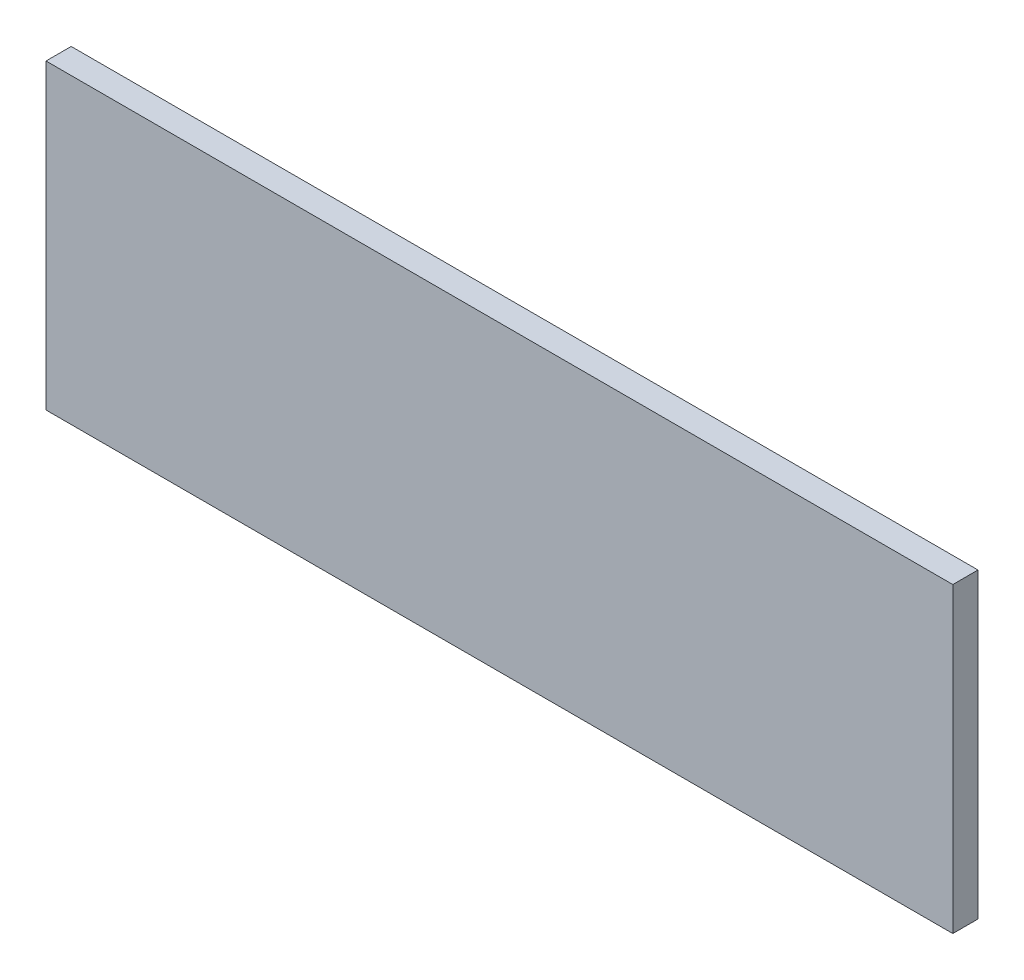
ISO-10303-21;
HEADER;
FILE_DESCRIPTION(('STEP AP214'),'2;1');
FILE_NAME('part.step','',(''),(''),'','','');
FILE_SCHEMA(('AUTOMOTIVE_DESIGN { 1 0 10303 214 1 1 1 1 }'));
ENDSEC;
DATA;
#1=APPLICATION_CONTEXT('core data for automotive mechanical design processes');
#2=APPLICATION_PROTOCOL_DEFINITION('international standard','automotive_design',2000,#1);
#3=PRODUCT_CONTEXT('',#1,'mechanical');
#4=PRODUCT('Part','Part','',(#3));
#5=PRODUCT_RELATED_PRODUCT_CATEGORY('part','',(#4));
#6=PRODUCT_DEFINITION_FORMATION('','',#4);
#7=PRODUCT_DEFINITION_CONTEXT('part definition',#1,'design');
#8=PRODUCT_DEFINITION('design','',#6,#7);
#9=PRODUCT_DEFINITION_SHAPE('','',#8);
#10=(LENGTH_UNIT() NAMED_UNIT(*) SI_UNIT(.MILLI.,.METRE.));
#11=(NAMED_UNIT(*) PLANE_ANGLE_UNIT() SI_UNIT($,.RADIAN.));
#12=(NAMED_UNIT(*) SI_UNIT($,.STERADIAN.) SOLID_ANGLE_UNIT());
#13=UNCERTAINTY_MEASURE_WITH_UNIT(LENGTH_MEASURE(1.E-05),#10,'distance_accuracy_value','');
#14=(GEOMETRIC_REPRESENTATION_CONTEXT(3) GLOBAL_UNCERTAINTY_ASSIGNED_CONTEXT((#13)) GLOBAL_UNIT_ASSIGNED_CONTEXT((#10,
#11,#12)) REPRESENTATION_CONTEXT('',''));
#15=CARTESIAN_POINT('',(0.,0.,0.));
#16=DIRECTION('',(0.,0.,1.));
#17=DIRECTION('',(1.,0.,0.));
#18=AXIS2_PLACEMENT_3D('',#15,#16,#17);
#19=CARTESIAN_POINT('',(-553.067486259618,0.,38.1));
#20=DIRECTION('',(0.,-1.,0.));
#21=DIRECTION('',(0.,0.,-1.));
#22=AXIS2_PLACEMENT_3D('',#19,#20,#21);
#23=PLANE('',#22);
#24=DIRECTION('',(-1.,0.,0.));
#25=VECTOR('',#24,1.);
#26=CARTESIAN_POINT('',(-553.067486259618,0.,0.));
#27=LINE('',#26,#25);
#28=CARTESIAN_POINT('',(0.,0.,0.));
#29=VERTEX_POINT('',#28);
#30=CARTESIAN_POINT('',(-1371.6,-1.11022302462516E-13,0.));
#31=VERTEX_POINT('',#30);
#32=EDGE_CURVE('E101',#29,#31,#27,.T.);
#33=ORIENTED_EDGE('',*,*,#32,.F.);
#34=DIRECTION('',(0.,0.,-1.));
#35=VECTOR('',#34,1.);
#36=CARTESIAN_POINT('',(0.,0.,38.1));
#37=LINE('',#36,#35);
#38=CARTESIAN_POINT('',(0.,0.,38.1));
#39=VERTEX_POINT('',#38);
#40=EDGE_CURVE('E10',#39,#29,#37,.T.);
#41=ORIENTED_EDGE('',*,*,#40,.F.);
#42=DIRECTION('',(-1.,0.,0.));
#43=VECTOR('',#42,1.);
#44=CARTESIAN_POINT('',(-553.067486259618,0.,38.1));
#45=LINE('',#44,#43);
#46=CARTESIAN_POINT('',(-1371.6,-1.11022302462516E-13,38.1));
#47=VERTEX_POINT('',#46);
#48=EDGE_CURVE('E79',#39,#47,#45,.T.);
#49=ORIENTED_EDGE('',*,*,#48,.T.);
#50=DIRECTION('',(0.,0.,-1.));
#51=VECTOR('',#50,1.);
#52=CARTESIAN_POINT('',(-1371.6,-1.11022302462516E-13,38.1));
#53=LINE('',#52,#51);
#54=EDGE_CURVE('E38',#47,#31,#53,.T.);
#55=ORIENTED_EDGE('',*,*,#54,.T.);
#56=EDGE_LOOP('',(#33,#41,#49,#55));
#57=FACE_BOUND('',#56,.T.);
#58=ADVANCED_FACE('F16',(#57),#23,.T.);
#59=CARTESIAN_POINT('',(0.,228.6,38.1));
#60=DIRECTION('',(-1.,0.,0.));
#61=DIRECTION('',(0.,0.,1.));
#62=AXIS2_PLACEMENT_3D('',#59,#60,#61);
#63=PLANE('',#62);
#64=DIRECTION('',(0.,1.,0.));
#65=VECTOR('',#64,1.);
#66=CARTESIAN_POINT('',(0.,228.6,0.));
#67=LINE('',#66,#65);
#68=CARTESIAN_POINT('',(0.,457.2,0.));
#69=VERTEX_POINT('',#68);
#70=EDGE_CURVE('E86',#29,#69,#67,.T.);
#71=ORIENTED_EDGE('',*,*,#70,.T.);
#72=DIRECTION('',(0.,0.,-1.));
#73=VECTOR('',#72,1.);
#74=CARTESIAN_POINT('',(0.,457.2,38.1));
#75=LINE('',#74,#73);
#76=CARTESIAN_POINT('',(0.,457.2,38.1));
#77=VERTEX_POINT('',#76);
#78=EDGE_CURVE('E25',#77,#69,#75,.T.);
#79=ORIENTED_EDGE('',*,*,#78,.F.);
#80=DIRECTION('',(0.,1.,0.));
#81=VECTOR('',#80,1.);
#82=CARTESIAN_POINT('',(0.,228.6,38.1));
#83=LINE('',#82,#81);
#84=EDGE_CURVE('E73',#39,#77,#83,.T.);
#85=ORIENTED_EDGE('',*,*,#84,.F.);
#86=ORIENTED_EDGE('',*,*,#40,.T.);
#87=EDGE_LOOP('',(#71,#79,#85,#86));
#88=FACE_BOUND('',#87,.T.);
#89=ADVANCED_FACE('F84',(#88),#63,.F.);
#90=CARTESIAN_POINT('',(-553.067486259618,457.2,38.1));
#91=DIRECTION('',(0.,-1.,0.));
#92=DIRECTION('',(0.,0.,-1.));
#93=AXIS2_PLACEMENT_3D('',#90,#91,#92);
#94=PLANE('',#93);
#95=DIRECTION('',(-1.,0.,0.));
#96=VECTOR('',#95,1.);
#97=CARTESIAN_POINT('',(-553.067486259618,457.2,0.));
#98=LINE('',#97,#96);
#99=CARTESIAN_POINT('',(-1371.6,457.2,0.));
#100=VERTEX_POINT('',#99);
#101=EDGE_CURVE('E105',#69,#100,#98,.T.);
#102=ORIENTED_EDGE('',*,*,#101,.T.);
#103=DIRECTION('',(0.,0.,-1.));
#104=VECTOR('',#103,1.);
#105=CARTESIAN_POINT('',(-1371.6,457.2,38.1));
#106=LINE('',#105,#104);
#107=CARTESIAN_POINT('',(-1371.6,457.2,38.1));
#108=VERTEX_POINT('',#107);
#109=EDGE_CURVE('E57',#108,#100,#106,.T.);
#110=ORIENTED_EDGE('',*,*,#109,.F.);
#111=DIRECTION('',(-1.,0.,0.));
#112=VECTOR('',#111,1.);
#113=CARTESIAN_POINT('',(-553.067486259618,457.2,38.1));
#114=LINE('',#113,#112);
#115=EDGE_CURVE('E78',#77,#108,#114,.T.);
#116=ORIENTED_EDGE('',*,*,#115,.F.);
#117=ORIENTED_EDGE('',*,*,#78,.T.);
#118=EDGE_LOOP('',(#102,#110,#116,#117));
#119=FACE_BOUND('',#118,.T.);
#120=ADVANCED_FACE('F90',(#119),#94,.F.);
#121=CARTESIAN_POINT('',(-1371.6,228.6,38.1));
#122=DIRECTION('',(-1.,0.,0.));
#123=DIRECTION('',(0.,-1.,0.));
#124=AXIS2_PLACEMENT_3D('',#121,#122,#123);
#125=PLANE('',#124);
#126=DIRECTION('',(0.,1.,0.));
#127=VECTOR('',#126,1.);
#128=CARTESIAN_POINT('',(-1371.6,228.6,0.));
#129=LINE('',#128,#127);
#130=EDGE_CURVE('E107',#31,#100,#129,.T.);
#131=ORIENTED_EDGE('',*,*,#130,.F.);
#132=ORIENTED_EDGE('',*,*,#54,.F.);
#133=DIRECTION('',(0.,1.,0.));
#134=VECTOR('',#133,1.);
#135=CARTESIAN_POINT('',(-1371.6,228.6,38.1));
#136=LINE('',#135,#134);
#137=EDGE_CURVE('E92',#47,#108,#136,.T.);
#138=ORIENTED_EDGE('',*,*,#137,.T.);
#139=ORIENTED_EDGE('',*,*,#109,.T.);
#140=EDGE_LOOP('',(#131,#132,#138,#139));
#141=FACE_BOUND('',#140,.T.);
#142=ADVANCED_FACE('F122',(#141),#125,.T.);
#143=CARTESIAN_POINT('',(-685.8,228.6,38.1));
#144=DIRECTION('',(0.,0.,1.));
#145=DIRECTION('',(1.,0.,0.));
#146=AXIS2_PLACEMENT_3D('',#143,#144,#145);
#147=PLANE('',#146);
#148=ORIENTED_EDGE('',*,*,#48,.F.);
#149=ORIENTED_EDGE('',*,*,#84,.T.);
#150=ORIENTED_EDGE('',*,*,#115,.T.);
#151=ORIENTED_EDGE('',*,*,#137,.F.);
#152=EDGE_LOOP('',(#148,#149,#150,#151));
#153=FACE_BOUND('',#152,.T.);
#154=ADVANCED_FACE('F75',(#153),#147,.T.);
#155=CARTESIAN_POINT('',(-685.8,228.6,0.));
#156=DIRECTION('',(0.,0.,1.));
#157=DIRECTION('',(1.,0.,0.));
#158=AXIS2_PLACEMENT_3D('',#155,#156,#157);
#159=PLANE('',#158);
#160=ORIENTED_EDGE('',*,*,#32,.T.);
#161=ORIENTED_EDGE('',*,*,#130,.T.);
#162=ORIENTED_EDGE('',*,*,#101,.F.);
#163=ORIENTED_EDGE('',*,*,#70,.F.);
#164=EDGE_LOOP('',(#160,#161,#162,#163));
#165=FACE_BOUND('',#164,.T.);
#166=ADVANCED_FACE('F129',(#165),#159,.F.);
#167=CLOSED_SHELL('',(#58,#89,#120,#142,#154,#166));
#168=MANIFOLD_SOLID_BREP('B1',#167);
#169=ADVANCED_BREP_SHAPE_REPRESENTATION('',(#18,#168),#14);
#170=SHAPE_DEFINITION_REPRESENTATION(#9,#169);
ENDSEC;
END-ISO-10303-21;
